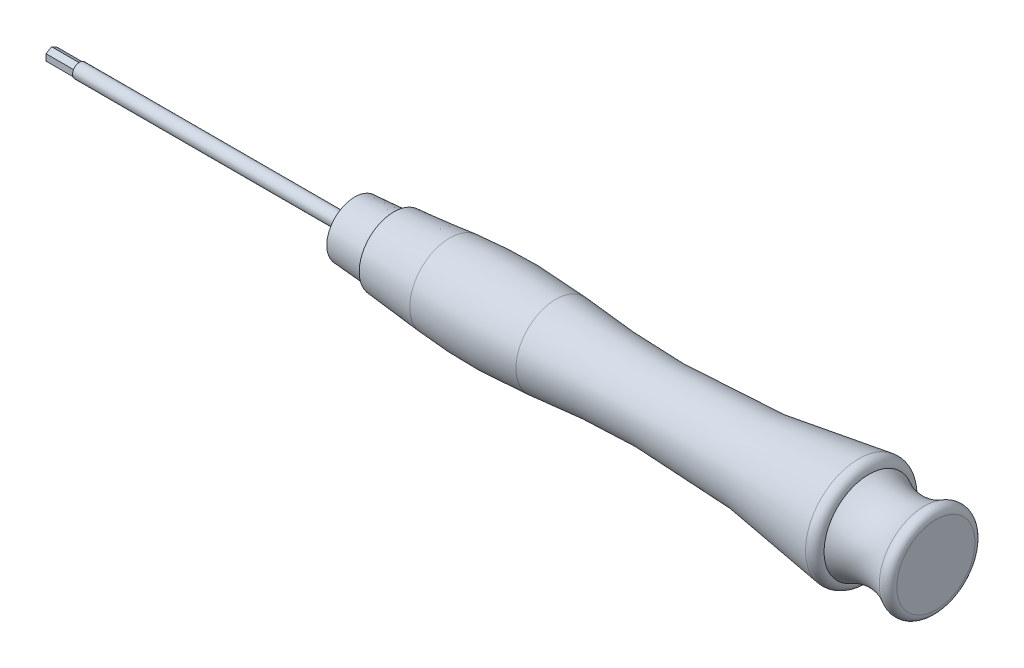
ISO-10303-21;
HEADER;
FILE_DESCRIPTION(('STEP AP214'),'2;1');
FILE_NAME('part.step','',(''),(''),'','','');
FILE_SCHEMA(('AUTOMOTIVE_DESIGN { 1 0 10303 214 1 1 1 1 }'));
ENDSEC;
DATA;
#1=APPLICATION_CONTEXT('core data for automotive mechanical design processes');
#2=APPLICATION_PROTOCOL_DEFINITION('international standard','automotive_design',2000,#1);
#3=PRODUCT_CONTEXT('',#1,'mechanical');
#4=PRODUCT('Part','Part','',(#3));
#5=PRODUCT_RELATED_PRODUCT_CATEGORY('part','',(#4));
#6=PRODUCT_DEFINITION_FORMATION('','',#4);
#7=PRODUCT_DEFINITION_CONTEXT('part definition',#1,'design');
#8=PRODUCT_DEFINITION('design','',#6,#7);
#9=PRODUCT_DEFINITION_SHAPE('','',#8);
#10=(LENGTH_UNIT() NAMED_UNIT(*) SI_UNIT(.MILLI.,.METRE.));
#11=(NAMED_UNIT(*) PLANE_ANGLE_UNIT() SI_UNIT($,.RADIAN.));
#12=(NAMED_UNIT(*) SI_UNIT($,.STERADIAN.) SOLID_ANGLE_UNIT());
#13=UNCERTAINTY_MEASURE_WITH_UNIT(LENGTH_MEASURE(1.E-05),#10,'distance_accuracy_value','');
#14=(GEOMETRIC_REPRESENTATION_CONTEXT(3) GLOBAL_UNCERTAINTY_ASSIGNED_CONTEXT((#13)) GLOBAL_UNIT_ASSIGNED_CONTEXT((#10,
#11,#12)) REPRESENTATION_CONTEXT('',''));
#15=CARTESIAN_POINT('',(0.,0.,0.));
#16=DIRECTION('',(0.,0.,1.));
#17=DIRECTION('',(1.,0.,0.));
#18=AXIS2_PLACEMENT_3D('',#15,#16,#17);
#19=CARTESIAN_POINT('',(10.25,0.,0.));
#20=DIRECTION('',(1.,0.,0.));
#21=DIRECTION('',(0.,0.,-1.));
#22=AXIS2_PLACEMENT_3D('',#19,#20,#21);
#23=PLANE('',#22);
#24=CARTESIAN_POINT('',(10.25,0.,0.));
#25=DIRECTION('',(1.,0.,0.));
#26=DIRECTION('',(0.,0.,-1.));
#27=AXIS2_PLACEMENT_3D('',#24,#25,#26);
#28=CIRCLE('',#27,1.25);
#29=CARTESIAN_POINT('',(10.25,0.,-1.25));
#30=VERTEX_POINT('',#29);
#31=EDGE_CURVE('E37',#30,#30,#28,.F.);
#32=ORIENTED_EDGE('',*,*,#31,.T.);
#33=EDGE_LOOP('',(#32));
#34=FACE_BOUND('',#33,.T.);
#35=DIRECTION('',(0.,-1.,0.));
#36=VECTOR('',#35,1.);
#37=CARTESIAN_POINT('',(10.25,-0.577350269189626,-1.));
#38=LINE('',#37,#36);
#39=CARTESIAN_POINT('',(10.25,0.577350269189626,-1.));
#40=VERTEX_POINT('',#39);
#41=CARTESIAN_POINT('',(10.25,-0.577350269189626,-1.));
#42=VERTEX_POINT('',#41);
#43=EDGE_CURVE('E106',#40,#42,#38,.T.);
#44=ORIENTED_EDGE('',*,*,#43,.F.);
#45=DIRECTION('',(0.,-0.5,-0.866025403784439));
#46=VECTOR('',#45,1.);
#47=CARTESIAN_POINT('',(10.25,0.577350269189626,-1.));
#48=LINE('',#47,#46);
#49=CARTESIAN_POINT('',(10.25,1.15470053837925,0.));
#50=VERTEX_POINT('',#49);
#51=EDGE_CURVE('E103',#50,#40,#48,.T.);
#52=ORIENTED_EDGE('',*,*,#51,.F.);
#53=DIRECTION('',(0.,0.5,-0.866025403784439));
#54=VECTOR('',#53,1.);
#55=CARTESIAN_POINT('',(10.25,1.15470053837925,0.));
#56=LINE('',#55,#54);
#57=CARTESIAN_POINT('',(10.25,0.577350269189626,1.));
#58=VERTEX_POINT('',#57);
#59=EDGE_CURVE('E346',#58,#50,#56,.T.);
#60=ORIENTED_EDGE('',*,*,#59,.F.);
#61=DIRECTION('',(0.,1.,0.));
#62=VECTOR('',#61,1.);
#63=CARTESIAN_POINT('',(10.25,0.577350269189626,1.));
#64=LINE('',#63,#62);
#65=CARTESIAN_POINT('',(10.25,-0.577350269189626,1.));
#66=VERTEX_POINT('',#65);
#67=EDGE_CURVE('E361',#66,#58,#64,.T.);
#68=ORIENTED_EDGE('',*,*,#67,.F.);
#69=DIRECTION('',(0.,0.5,0.866025403784439));
#70=VECTOR('',#69,1.);
#71=CARTESIAN_POINT('',(10.25,-0.577350269189626,1.));
#72=LINE('',#71,#70);
#73=CARTESIAN_POINT('',(10.25,-1.15470053837925,0.));
#74=VERTEX_POINT('',#73);
#75=EDGE_CURVE('E53',#74,#66,#72,.T.);
#76=ORIENTED_EDGE('',*,*,#75,.F.);
#77=DIRECTION('',(0.,-0.5,0.866025403784439));
#78=VECTOR('',#77,1.);
#79=CARTESIAN_POINT('',(10.25,-1.15470053837925,0.));
#80=LINE('',#79,#78);
#81=EDGE_CURVE('E48',#42,#74,#80,.T.);
#82=ORIENTED_EDGE('',*,*,#81,.F.);
#83=EDGE_LOOP('',(#44,#52,#60,#68,#76,#82));
#84=FACE_BOUND('',#83,.T.);
#85=ADVANCED_FACE('F33',(#34,#84),#23,.F.);
#86=CARTESIAN_POINT('',(184.722030443975,0.,0.));
#87=DIRECTION('',(1.,0.,0.));
#88=DIRECTION('',(0.,0.,-1.));
#89=AXIS2_PLACEMENT_3D('',#86,#87,#88);
#90=CYLINDRICAL_SURFACE('',#89,1.25);
#91=ORIENTED_EDGE('',*,*,#31,.F.);
#92=EDGE_LOOP('',(#91));
#93=FACE_BOUND('',#92,.T.);
#94=CARTESIAN_POINT('',(59.5,0.,0.));
#95=DIRECTION('',(1.,0.,0.));
#96=DIRECTION('',(0.,0.,-1.));
#97=AXIS2_PLACEMENT_3D('',#94,#95,#96);
#98=CIRCLE('',#97,1.25);
#99=CARTESIAN_POINT('',(59.5,0.,-1.25));
#100=VERTEX_POINT('',#99);
#101=EDGE_CURVE('E11',#100,#100,#98,.T.);
#102=ORIENTED_EDGE('',*,*,#101,.F.);
#103=EDGE_LOOP('',(#102));
#104=FACE_BOUND('',#103,.T.);
#105=ADVANCED_FACE('F35',(#93,#104),#90,.T.);
#106=CARTESIAN_POINT('',(59.5,0.,0.));
#107=DIRECTION('',(-1.,0.,0.));
#108=DIRECTION('',(0.,0.,1.));
#109=AXIS2_PLACEMENT_3D('',#106,#107,#108);
#110=PLANE('',#109);
#111=ORIENTED_EDGE('',*,*,#101,.T.);
#112=EDGE_LOOP('',(#111));
#113=FACE_BOUND('',#112,.T.);
#114=CARTESIAN_POINT('',(59.5,0.,0.));
#115=DIRECTION('',(1.,0.,0.));
#116=DIRECTION('',(0.,0.,-1.));
#117=AXIS2_PLACEMENT_3D('',#114,#115,#116);
#118=CIRCLE('',#117,5.);
#119=CARTESIAN_POINT('',(59.5,0.,-5.));
#120=VERTEX_POINT('',#119);
#121=EDGE_CURVE('E136',#120,#120,#118,.T.);
#122=ORIENTED_EDGE('',*,*,#121,.F.);
#123=EDGE_LOOP('',(#122));
#124=FACE_BOUND('',#123,.T.);
#125=ADVANCED_FACE('F146',(#113,#124),#110,.T.);
#126=CARTESIAN_POINT('',(66.5,0.,0.));
#127=DIRECTION('',(1.,0.,0.));
#128=DIRECTION('',(0.,0.,-1.));
#129=AXIS2_PLACEMENT_3D('',#126,#127,#128);
#130=CONICAL_SURFACE('',#129,5.5,0.0713074647852902);
#131=ORIENTED_EDGE('',*,*,#121,.T.);
#132=EDGE_LOOP('',(#131));
#133=FACE_BOUND('',#132,.T.);
#134=CARTESIAN_POINT('',(66.5,0.,0.));
#135=DIRECTION('',(1.,0.,0.));
#136=DIRECTION('',(0.,0.,-1.));
#137=AXIS2_PLACEMENT_3D('',#134,#135,#136);
#138=CIRCLE('',#137,5.5);
#139=CARTESIAN_POINT('',(66.5,0.,-5.5));
#140=VERTEX_POINT('',#139);
#141=EDGE_CURVE('E133',#140,#140,#138,.T.);
#142=ORIENTED_EDGE('',*,*,#141,.F.);
#143=EDGE_LOOP('',(#142));
#144=FACE_BOUND('',#143,.T.);
#145=ADVANCED_FACE('F151',(#133,#144),#130,.T.);
#146=CARTESIAN_POINT('',(66.5,0.,0.));
#147=DIRECTION('',(-1.,0.,0.));
#148=DIRECTION('',(0.,0.,1.));
#149=AXIS2_PLACEMENT_3D('',#146,#147,#148);
#150=PLANE('',#149);
#151=ORIENTED_EDGE('',*,*,#141,.T.);
#152=EDGE_LOOP('',(#151));
#153=FACE_BOUND('',#152,.T.);
#154=CARTESIAN_POINT('',(66.5,0.,0.));
#155=DIRECTION('',(1.,0.,0.));
#156=DIRECTION('',(0.,0.,-1.));
#157=AXIS2_PLACEMENT_3D('',#154,#155,#156);
#158=CIRCLE('',#157,6.19568388824699);
#159=CARTESIAN_POINT('',(66.5,0.,-6.19568388824699));
#160=VERTEX_POINT('',#159);
#161=EDGE_CURVE('E124',#160,#160,#158,.T.);
#162=ORIENTED_EDGE('',*,*,#161,.F.);
#163=EDGE_LOOP('',(#162));
#164=FACE_BOUND('',#163,.T.);
#165=ADVANCED_FACE('F156',(#153,#164),#150,.T.);
#166=CARTESIAN_POINT('',(86.,0.,0.));
#167=DIRECTION('',(1.,0.,0.));
#168=DIRECTION('',(0.,0.,-1.));
#169=AXIS2_PLACEMENT_3D('',#166,#167,#168);
#170=DEGENERATE_TOROIDAL_SURFACE('',#169,92.3977272467835,100.,.F.);
#171=CARTESIAN_POINT('',(76.5,0.,0.));
#172=DIRECTION('',(1.,0.,0.));
#173=DIRECTION('',(0.,0.,-1.));
#174=AXIS2_PLACEMENT_3D('',#171,#172,#173);
#175=CIRCLE('',#174,7.15);
#176=CARTESIAN_POINT('',(76.5,0.,-7.15));
#177=VERTEX_POINT('',#176);
#178=EDGE_CURVE('E127',#177,#177,#175,.T.);
#179=ORIENTED_EDGE('',*,*,#178,.T.);
#180=EDGE_LOOP('',(#179));
#181=FACE_BOUND('',#180,.T.);
#182=CARTESIAN_POINT('',(95.5,0.,0.));
#183=DIRECTION('',(1.,0.,0.));
#184=DIRECTION('',(0.,0.,-1.));
#185=AXIS2_PLACEMENT_3D('',#182,#183,#184);
#186=CIRCLE('',#185,7.15);
#187=CARTESIAN_POINT('',(95.5,0.,-7.15));
#188=VERTEX_POINT('',#187);
#189=EDGE_CURVE('E130',#188,#188,#186,.T.);
#190=ORIENTED_EDGE('',*,*,#189,.F.);
#191=EDGE_LOOP('',(#190));
#192=FACE_BOUND('',#191,.T.);
#193=ADVANCED_FACE('F256',(#181,#192),#170,.F.);
#194=CARTESIAN_POINT('',(76.5,0.,0.));
#195=DIRECTION('',(1.,0.,0.));
#196=DIRECTION('',(0.,0.,-1.));
#197=AXIS2_PLACEMENT_3D('',#194,#195,#196);
#198=CONICAL_SURFACE('',#197,7.15,0.0951434793058894);
#199=ORIENTED_EDGE('',*,*,#161,.T.);
#200=EDGE_LOOP('',(#199));
#201=FACE_BOUND('',#200,.T.);
#202=ORIENTED_EDGE('',*,*,#178,.F.);
#203=EDGE_LOOP('',(#202));
#204=FACE_BOUND('',#203,.T.);
#205=ADVANCED_FACE('F252',(#201,#204),#198,.T.);
#206=CARTESIAN_POINT('',(149.970223747397,0.,0.));
#207=DIRECTION('',(1.,0.,0.));
#208=DIRECTION('',(0.,0.,-1.));
#209=AXIS2_PLACEMENT_3D('',#206,#207,#208);
#210=TOROIDAL_SURFACE('',#209,8.,1.5297762526034);
#211=CARTESIAN_POINT('',(149.669864990192,0.,0.));
#212=DIRECTION('',(1.,0.,0.));
#213=DIRECTION('',(0.,0.,-1.));
#214=AXIS2_PLACEMENT_3D('',#211,#212,#213);
#215=CIRCLE('',#214,9.50000000000001);
#216=CARTESIAN_POINT('',(149.669864990192,0.,-9.50000000000001));
#217=VERTEX_POINT('',#216);
#218=EDGE_CURVE('E118',#217,#217,#215,.T.);
#219=ORIENTED_EDGE('',*,*,#218,.T.);
#220=EDGE_LOOP('',(#219));
#221=FACE_BOUND('',#220,.T.);
#222=CARTESIAN_POINT('',(151.5,0.,0.));
#223=DIRECTION('',(1.,0.,0.));
#224=DIRECTION('',(0.,0.,-1.));
#225=AXIS2_PLACEMENT_3D('',#222,#223,#224);
#226=CIRCLE('',#225,8.);
#227=CARTESIAN_POINT('',(151.5,0.,-8.));
#228=VERTEX_POINT('',#227);
#229=EDGE_CURVE('E121',#228,#228,#226,.T.);
#230=ORIENTED_EDGE('',*,*,#229,.F.);
#231=EDGE_LOOP('',(#230));
#232=FACE_BOUND('',#231,.T.);
#233=ADVANCED_FACE('F248',(#221,#232),#210,.T.);
#234=CARTESIAN_POINT('',(115.028966963282,0.,0.));
#235=DIRECTION('',(1.,0.,0.));
#236=DIRECTION('',(0.,0.,-1.));
#237=AXIS2_PLACEMENT_3D('',#234,#235,#236);
#238=TOROIDAL_SURFACE('',#237,182.497609671887,176.431756688804);
#239=ORIENTED_EDGE('',*,*,#189,.T.);
#240=EDGE_LOOP('',(#239));
#241=FACE_BOUND('',#240,.T.);
#242=ORIENTED_EDGE('',*,*,#218,.F.);
#243=EDGE_LOOP('',(#242));
#244=FACE_BOUND('',#243,.T.);
#245=ADVANCED_FACE('F244',(#241,#244),#238,.F.);
#246=CARTESIAN_POINT('',(156.392433730316,0.,0.));
#247=DIRECTION('',(1.,0.,0.));
#248=DIRECTION('',(0.,0.,-1.));
#249=AXIS2_PLACEMENT_3D('',#246,#247,#248);
#250=TOROIDAL_SURFACE('',#249,16.5561183867437,9.85611838674373);
#251=ORIENTED_EDGE('',*,*,#229,.T.);
#252=EDGE_LOOP('',(#251));
#253=FACE_BOUND('',#252,.T.);
#254=CARTESIAN_POINT('',(161.5,0.,0.));
#255=DIRECTION('',(1.,0.,0.));
#256=DIRECTION('',(0.,0.,-1.));
#257=AXIS2_PLACEMENT_3D('',#254,#255,#256);
#258=CIRCLE('',#257,8.12665598073621);
#259=CARTESIAN_POINT('',(161.5,0.,-8.12665598073621));
#260=VERTEX_POINT('',#259);
#261=EDGE_CURVE('E110',#260,#260,#258,.T.);
#262=ORIENTED_EDGE('',*,*,#261,.F.);
#263=EDGE_LOOP('',(#262));
#264=FACE_BOUND('',#263,.T.);
#265=ADVANCED_FACE('F240',(#253,#264),#250,.F.);
#266=CARTESIAN_POINT('',(162.182661575268,0.,0.));
#267=DIRECTION('',(1.,0.,0.));
#268=DIRECTION('',(0.,0.,-1.));
#269=AXIS2_PLACEMENT_3D('',#266,#267,#268);
#270=TOROIDAL_SURFACE('',#269,7.,1.31733842473218);
#271=ORIENTED_EDGE('',*,*,#261,.T.);
#272=EDGE_LOOP('',(#271));
#273=FACE_BOUND('',#272,.T.);
#274=CARTESIAN_POINT('',(163.5,0.,0.));
#275=DIRECTION('',(1.,0.,0.));
#276=DIRECTION('',(0.,0.,-1.));
#277=AXIS2_PLACEMENT_3D('',#274,#275,#276);
#278=CIRCLE('',#277,7.);
#279=CARTESIAN_POINT('',(163.5,0.,-7.));
#280=VERTEX_POINT('',#279);
#281=EDGE_CURVE('E107',#280,#280,#278,.T.);
#282=ORIENTED_EDGE('',*,*,#281,.F.);
#283=EDGE_LOOP('',(#282));
#284=FACE_BOUND('',#283,.T.);
#285=ADVANCED_FACE('F236',(#273,#284),#270,.T.);
#286=CARTESIAN_POINT('',(163.5,0.,0.));
#287=DIRECTION('',(1.,0.,0.));
#288=DIRECTION('',(0.,0.,-1.));
#289=AXIS2_PLACEMENT_3D('',#286,#287,#288);
#290=PLANE('',#289);
#291=ORIENTED_EDGE('',*,*,#281,.T.);
#292=EDGE_LOOP('',(#291));
#293=FACE_BOUND('',#292,.T.);
#294=ADVANCED_FACE('F168',(#293),#290,.T.);
#295=CARTESIAN_POINT('',(5.25,-0.577350269189626,-1.));
#296=DIRECTION('',(0.,0.,1.));
#297=DIRECTION('',(1.,0.,0.));
#298=AXIS2_PLACEMENT_3D('',#295,#296,#297);
#299=PLANE('',#298);
#300=ORIENTED_EDGE('',*,*,#43,.T.);
#301=DIRECTION('',(1.,0.,0.));
#302=VECTOR('',#301,1.);
#303=CARTESIAN_POINT('',(5.25,-0.577350269189626,-1.));
#304=LINE('',#303,#302);
#305=CARTESIAN_POINT('',(5.25,-0.577350269189626,-1.));
#306=VERTEX_POINT('',#305);
#307=EDGE_CURVE('E87',#306,#42,#304,.T.);
#308=ORIENTED_EDGE('',*,*,#307,.F.);
#309=DIRECTION('',(0.,-1.,0.));
#310=VECTOR('',#309,1.);
#311=CARTESIAN_POINT('',(5.25,-0.577350269189626,-1.));
#312=LINE('',#311,#310);
#313=CARTESIAN_POINT('',(5.25,0.577350269189626,-1.));
#314=VERTEX_POINT('',#313);
#315=EDGE_CURVE('E94',#314,#306,#312,.T.);
#316=ORIENTED_EDGE('',*,*,#315,.F.);
#317=DIRECTION('',(1.,0.,0.));
#318=VECTOR('',#317,1.);
#319=CARTESIAN_POINT('',(5.25,0.577350269189626,-1.));
#320=LINE('',#319,#318);
#321=EDGE_CURVE('E342',#314,#40,#320,.T.);
#322=ORIENTED_EDGE('',*,*,#321,.T.);
#323=EDGE_LOOP('',(#300,#308,#316,#322));
#324=FACE_BOUND('',#323,.T.);
#325=ADVANCED_FACE('F105',(#324),#299,.F.);
#326=CARTESIAN_POINT('',(5.25,-1.15470053837925,0.));
#327=DIRECTION('',(0.,0.866025403784439,0.5));
#328=DIRECTION('',(0.,-0.5,0.866025403784439));
#329=AXIS2_PLACEMENT_3D('',#326,#327,#328);
#330=PLANE('',#329);
#331=ORIENTED_EDGE('',*,*,#81,.T.);
#332=DIRECTION('',(1.,0.,0.));
#333=VECTOR('',#332,1.);
#334=CARTESIAN_POINT('',(5.25,-1.15470053837925,0.));
#335=LINE('',#334,#333);
#336=CARTESIAN_POINT('',(5.25,-1.15470053837925,0.));
#337=VERTEX_POINT('',#336);
#338=EDGE_CURVE('E90',#337,#74,#335,.T.);
#339=ORIENTED_EDGE('',*,*,#338,.F.);
#340=DIRECTION('',(0.,-0.5,0.866025403784439));
#341=VECTOR('',#340,1.);
#342=CARTESIAN_POINT('',(5.25,-1.15470053837925,0.));
#343=LINE('',#342,#341);
#344=EDGE_CURVE('E83',#306,#337,#343,.T.);
#345=ORIENTED_EDGE('',*,*,#344,.F.);
#346=ORIENTED_EDGE('',*,*,#307,.T.);
#347=EDGE_LOOP('',(#331,#339,#345,#346));
#348=FACE_BOUND('',#347,.T.);
#349=ADVANCED_FACE('F85',(#348),#330,.F.);
#350=CARTESIAN_POINT('',(5.25,-0.577350269189626,1.));
#351=DIRECTION('',(0.,0.866025403784439,-0.5));
#352=DIRECTION('',(0.,0.5,0.866025403784439));
#353=AXIS2_PLACEMENT_3D('',#350,#351,#352);
#354=PLANE('',#353);
#355=ORIENTED_EDGE('',*,*,#75,.T.);
#356=DIRECTION('',(1.,0.,0.));
#357=VECTOR('',#356,1.);
#358=CARTESIAN_POINT('',(5.25,-0.577350269189626,1.));
#359=LINE('',#358,#357);
#360=CARTESIAN_POINT('',(5.25,-0.577350269189626,1.));
#361=VERTEX_POINT('',#360);
#362=EDGE_CURVE('E112',#361,#66,#359,.T.);
#363=ORIENTED_EDGE('',*,*,#362,.F.);
#364=DIRECTION('',(0.,0.5,0.866025403784439));
#365=VECTOR('',#364,1.);
#366=CARTESIAN_POINT('',(5.25,-0.577350269189626,1.));
#367=LINE('',#366,#365);
#368=EDGE_CURVE('E93',#337,#361,#367,.T.);
#369=ORIENTED_EDGE('',*,*,#368,.F.);
#370=ORIENTED_EDGE('',*,*,#338,.T.);
#371=EDGE_LOOP('',(#355,#363,#369,#370));
#372=FACE_BOUND('',#371,.T.);
#373=ADVANCED_FACE('F183',(#372),#354,.F.);
#374=CARTESIAN_POINT('',(5.25,0.577350269189626,1.));
#375=DIRECTION('',(0.,0.,-1.));
#376=DIRECTION('',(-1.,0.,0.));
#377=AXIS2_PLACEMENT_3D('',#374,#375,#376);
#378=PLANE('',#377);
#379=ORIENTED_EDGE('',*,*,#67,.T.);
#380=DIRECTION('',(1.,0.,0.));
#381=VECTOR('',#380,1.);
#382=CARTESIAN_POINT('',(5.25,0.577350269189626,1.));
#383=LINE('',#382,#381);
#384=CARTESIAN_POINT('',(5.25,0.577350269189626,1.));
#385=VERTEX_POINT('',#384);
#386=EDGE_CURVE('E349',#385,#58,#383,.T.);
#387=ORIENTED_EDGE('',*,*,#386,.F.);
#388=DIRECTION('',(0.,1.,0.));
#389=VECTOR('',#388,1.);
#390=CARTESIAN_POINT('',(5.25,0.577350269189626,1.));
#391=LINE('',#390,#389);
#392=EDGE_CURVE('E362',#361,#385,#391,.T.);
#393=ORIENTED_EDGE('',*,*,#392,.F.);
#394=ORIENTED_EDGE('',*,*,#362,.T.);
#395=EDGE_LOOP('',(#379,#387,#393,#394));
#396=FACE_BOUND('',#395,.T.);
#397=ADVANCED_FACE('F192',(#396),#378,.F.);
#398=CARTESIAN_POINT('',(5.25,1.15470053837925,0.));
#399=DIRECTION('',(0.,-0.866025403784439,-0.5));
#400=DIRECTION('',(0.,0.5,-0.866025403784439));
#401=AXIS2_PLACEMENT_3D('',#398,#399,#400);
#402=PLANE('',#401);
#403=ORIENTED_EDGE('',*,*,#59,.T.);
#404=DIRECTION('',(1.,0.,0.));
#405=VECTOR('',#404,1.);
#406=CARTESIAN_POINT('',(5.25,1.15470053837925,0.));
#407=LINE('',#406,#405);
#408=CARTESIAN_POINT('',(5.25,1.15470053837925,0.));
#409=VERTEX_POINT('',#408);
#410=EDGE_CURVE('E344',#409,#50,#407,.T.);
#411=ORIENTED_EDGE('',*,*,#410,.F.);
#412=DIRECTION('',(0.,0.5,-0.866025403784439));
#413=VECTOR('',#412,1.);
#414=CARTESIAN_POINT('',(5.25,1.15470053837925,0.));
#415=LINE('',#414,#413);
#416=EDGE_CURVE('E351',#385,#409,#415,.T.);
#417=ORIENTED_EDGE('',*,*,#416,.F.);
#418=ORIENTED_EDGE('',*,*,#386,.T.);
#419=EDGE_LOOP('',(#403,#411,#417,#418));
#420=FACE_BOUND('',#419,.T.);
#421=ADVANCED_FACE('F202',(#420),#402,.F.);
#422=CARTESIAN_POINT('',(5.25,0.577350269189626,-1.));
#423=DIRECTION('',(0.,-0.866025403784439,0.5));
#424=DIRECTION('',(0.,-0.5,-0.866025403784439));
#425=AXIS2_PLACEMENT_3D('',#422,#423,#424);
#426=PLANE('',#425);
#427=ORIENTED_EDGE('',*,*,#51,.T.);
#428=ORIENTED_EDGE('',*,*,#321,.F.);
#429=DIRECTION('',(0.,-0.5,-0.866025403784439));
#430=VECTOR('',#429,1.);
#431=CARTESIAN_POINT('',(5.25,0.577350269189626,-1.));
#432=LINE('',#431,#430);
#433=EDGE_CURVE('E99',#409,#314,#432,.T.);
#434=ORIENTED_EDGE('',*,*,#433,.F.);
#435=ORIENTED_EDGE('',*,*,#410,.T.);
#436=EDGE_LOOP('',(#427,#428,#434,#435));
#437=FACE_BOUND('',#436,.T.);
#438=ADVANCED_FACE('F212',(#437),#426,.F.);
#439=CARTESIAN_POINT('',(5.25,0.,0.));
#440=DIRECTION('',(1.,0.,0.));
#441=DIRECTION('',(0.,0.,-1.));
#442=AXIS2_PLACEMENT_3D('',#439,#440,#441);
#443=PLANE('',#442);
#444=ORIENTED_EDGE('',*,*,#315,.T.);
#445=ORIENTED_EDGE('',*,*,#344,.T.);
#446=ORIENTED_EDGE('',*,*,#368,.T.);
#447=ORIENTED_EDGE('',*,*,#392,.T.);
#448=ORIENTED_EDGE('',*,*,#416,.T.);
#449=ORIENTED_EDGE('',*,*,#433,.T.);
#450=EDGE_LOOP('',(#444,#445,#446,#447,#448,#449));
#451=FACE_BOUND('',#450,.T.);
#452=ADVANCED_FACE('F97',(#451),#443,.F.);
#453=CLOSED_SHELL('',(#85,#105,#125,#145,#165,#193,#205,#233,#245,#265,#285,#294,#325,#349,#373,
#397,#421,#438,#452));
#454=MANIFOLD_SOLID_BREP('B2',#453);
#455=ADVANCED_BREP_SHAPE_REPRESENTATION('',(#18,#454),#14);
#456=SHAPE_DEFINITION_REPRESENTATION(#9,#455);
ENDSEC;
END-ISO-10303-21;
